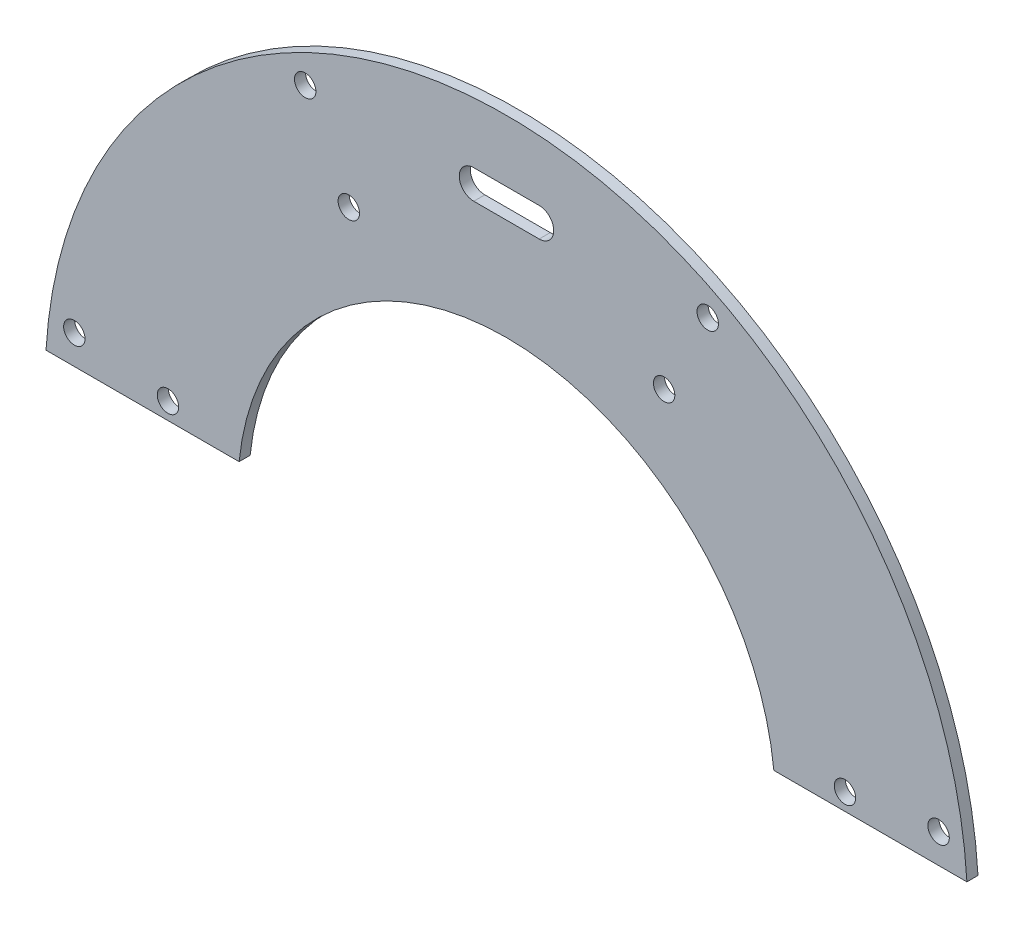
ISO-10303-21;
HEADER;
FILE_DESCRIPTION(('STEP AP214'),'2;1');
FILE_NAME('part.step','',(''),(''),'','','');
FILE_SCHEMA(('AUTOMOTIVE_DESIGN { 1 0 10303 214 1 1 1 1 }'));
ENDSEC;
DATA;
#1=APPLICATION_CONTEXT('core data for automotive mechanical design processes');
#2=APPLICATION_PROTOCOL_DEFINITION('international standard','automotive_design',2000,#1);
#3=PRODUCT_CONTEXT('',#1,'mechanical');
#4=PRODUCT('Part','Part','',(#3));
#5=PRODUCT_RELATED_PRODUCT_CATEGORY('part','',(#4));
#6=PRODUCT_DEFINITION_FORMATION('','',#4);
#7=PRODUCT_DEFINITION_CONTEXT('part definition',#1,'design');
#8=PRODUCT_DEFINITION('design','',#6,#7);
#9=PRODUCT_DEFINITION_SHAPE('','',#8);
#10=(LENGTH_UNIT() NAMED_UNIT(*) SI_UNIT(.MILLI.,.METRE.));
#11=(NAMED_UNIT(*) PLANE_ANGLE_UNIT() SI_UNIT($,.RADIAN.));
#12=(NAMED_UNIT(*) SI_UNIT($,.STERADIAN.) SOLID_ANGLE_UNIT());
#13=UNCERTAINTY_MEASURE_WITH_UNIT(LENGTH_MEASURE(1.E-05),#10,'distance_accuracy_value','');
#14=(GEOMETRIC_REPRESENTATION_CONTEXT(3) GLOBAL_UNCERTAINTY_ASSIGNED_CONTEXT((#13)) GLOBAL_UNIT_ASSIGNED_CONTEXT((#10,
#11,#12)) REPRESENTATION_CONTEXT('',''));
#15=CARTESIAN_POINT('',(0.,0.,0.));
#16=DIRECTION('',(0.,0.,1.));
#17=DIRECTION('',(1.,0.,0.));
#18=AXIS2_PLACEMENT_3D('',#15,#16,#17);
#19=CARTESIAN_POINT('',(0.,0.,0.762));
#20=DIRECTION('',(0.,0.,-1.));
#21=DIRECTION('',(-1.,0.,0.));
#22=AXIS2_PLACEMENT_3D('',#19,#20,#21);
#23=CYLINDRICAL_SURFACE('',#22,63.5);
#24=CARTESIAN_POINT('',(0.,0.,-0.762));
#25=DIRECTION('',(0.,0.,1.));
#26=DIRECTION('',(1.,0.,0.));
#27=AXIS2_PLACEMENT_3D('',#24,#25,#26);
#28=CIRCLE('',#27,63.5);
#29=CARTESIAN_POINT('',(63.3861972356758,3.79999999999999,-0.762));
#30=VERTEX_POINT('',#29);
#31=CARTESIAN_POINT('',(-63.3861972356758,3.79999999999999,-0.762));
#32=VERTEX_POINT('',#31);
#33=EDGE_CURVE('E175',#30,#32,#28,.T.);
#34=ORIENTED_EDGE('',*,*,#33,.T.);
#35=DIRECTION('',(0.,0.,-1.));
#36=VECTOR('',#35,1.);
#37=CARTESIAN_POINT('',(-63.3861972356758,3.79999999999999,0.762));
#38=LINE('',#37,#36);
#39=CARTESIAN_POINT('',(-63.3861972356758,3.79999999999999,0.762));
#40=VERTEX_POINT('',#39);
#41=EDGE_CURVE('E11',#40,#32,#38,.T.);
#42=ORIENTED_EDGE('',*,*,#41,.F.);
#43=CARTESIAN_POINT('',(0.,0.,0.762));
#44=DIRECTION('',(0.,0.,1.));
#45=DIRECTION('',(1.,0.,0.));
#46=AXIS2_PLACEMENT_3D('',#43,#44,#45);
#47=CIRCLE('',#46,63.5);
#48=CARTESIAN_POINT('',(63.3861972356758,3.79999999999999,0.762));
#49=VERTEX_POINT('',#48);
#50=EDGE_CURVE('E176',#49,#40,#47,.T.);
#51=ORIENTED_EDGE('',*,*,#50,.F.);
#52=DIRECTION('',(0.,0.,-1.));
#53=VECTOR('',#52,1.);
#54=CARTESIAN_POINT('',(63.3861972356758,3.79999999999999,0.762));
#55=LINE('',#54,#53);
#56=EDGE_CURVE('E186',#49,#30,#55,.T.);
#57=ORIENTED_EDGE('',*,*,#56,.T.);
#58=EDGE_LOOP('',(#34,#42,#51,#57));
#59=FACE_BOUND('',#58,.T.);
#60=ADVANCED_FACE('F34',(#59),#23,.T.);
#61=CARTESIAN_POINT('',(-63.3861972356758,3.79999999999999,0.762));
#62=DIRECTION('',(0.,1.,0.));
#63=DIRECTION('',(0.,0.,1.));
#64=AXIS2_PLACEMENT_3D('',#61,#62,#63);
#65=PLANE('',#64);
#66=DIRECTION('',(1.,0.,0.));
#67=VECTOR('',#66,1.);
#68=CARTESIAN_POINT('',(-63.3861972356758,3.79999999999999,-0.762));
#69=LINE('',#68,#67);
#70=CARTESIAN_POINT('',(-36.804347569275,3.79999999999999,-0.762));
#71=VERTEX_POINT('',#70);
#72=EDGE_CURVE('E189',#32,#71,#69,.T.);
#73=ORIENTED_EDGE('',*,*,#72,.T.);
#74=DIRECTION('',(0.,0.,-1.));
#75=VECTOR('',#74,1.);
#76=CARTESIAN_POINT('',(-36.804347569275,3.79999999999999,0.762));
#77=LINE('',#76,#75);
#78=CARTESIAN_POINT('',(-36.804347569275,3.79999999999999,0.762));
#79=VERTEX_POINT('',#78);
#80=EDGE_CURVE('E42',#79,#71,#77,.T.);
#81=ORIENTED_EDGE('',*,*,#80,.F.);
#82=DIRECTION('',(1.,0.,0.));
#83=VECTOR('',#82,1.);
#84=CARTESIAN_POINT('',(-63.3861972356758,3.79999999999999,0.762));
#85=LINE('',#84,#83);
#86=EDGE_CURVE('E179',#40,#79,#85,.T.);
#87=ORIENTED_EDGE('',*,*,#86,.F.);
#88=ORIENTED_EDGE('',*,*,#41,.T.);
#89=EDGE_LOOP('',(#73,#81,#87,#88));
#90=FACE_BOUND('',#89,.T.);
#91=ADVANCED_FACE('F225',(#90),#65,.F.);
#92=CARTESIAN_POINT('',(0.,0.,0.762));
#93=DIRECTION('',(0.,0.,-1.));
#94=DIRECTION('',(-1.,0.,0.));
#95=AXIS2_PLACEMENT_3D('',#92,#93,#94);
#96=CYLINDRICAL_SURFACE('',#95,37.);
#97=CARTESIAN_POINT('',(0.,0.,-0.762));
#98=DIRECTION('',(0.,0.,-1.));
#99=DIRECTION('',(-1.,0.,0.));
#100=AXIS2_PLACEMENT_3D('',#97,#98,#99);
#101=CIRCLE('',#100,37.);
#102=CARTESIAN_POINT('',(36.804347569275,3.79999999999998,-0.762));
#103=VERTEX_POINT('',#102);
#104=EDGE_CURVE('E191',#71,#103,#101,.T.);
#105=ORIENTED_EDGE('',*,*,#104,.T.);
#106=DIRECTION('',(0.,0.,-1.));
#107=VECTOR('',#106,1.);
#108=CARTESIAN_POINT('',(36.804347569275,3.79999999999998,0.762));
#109=LINE('',#108,#107);
#110=CARTESIAN_POINT('',(36.804347569275,3.79999999999998,0.762));
#111=VERTEX_POINT('',#110);
#112=EDGE_CURVE('E196',#111,#103,#109,.T.);
#113=ORIENTED_EDGE('',*,*,#112,.F.);
#114=CARTESIAN_POINT('',(0.,0.,0.762));
#115=DIRECTION('',(0.,0.,-1.));
#116=DIRECTION('',(-1.,0.,0.));
#117=AXIS2_PLACEMENT_3D('',#114,#115,#116);
#118=CIRCLE('',#117,37.);
#119=EDGE_CURVE('E182',#79,#111,#118,.T.);
#120=ORIENTED_EDGE('',*,*,#119,.F.);
#121=ORIENTED_EDGE('',*,*,#80,.T.);
#122=EDGE_LOOP('',(#105,#113,#120,#121));
#123=FACE_BOUND('',#122,.T.);
#124=ADVANCED_FACE('F230',(#123),#96,.F.);
#125=CARTESIAN_POINT('',(36.804347569275,3.79999999999999,0.762));
#126=DIRECTION('',(0.,1.,0.));
#127=DIRECTION('',(0.,0.,1.));
#128=AXIS2_PLACEMENT_3D('',#125,#126,#127);
#129=PLANE('',#128);
#130=DIRECTION('',(1.,0.,0.));
#131=VECTOR('',#130,1.);
#132=CARTESIAN_POINT('',(36.804347569275,3.79999999999999,-0.762));
#133=LINE('',#132,#131);
#134=EDGE_CURVE('E180',#103,#30,#133,.T.);
#135=ORIENTED_EDGE('',*,*,#134,.T.);
#136=ORIENTED_EDGE('',*,*,#56,.F.);
#137=DIRECTION('',(1.,0.,0.));
#138=VECTOR('',#137,1.);
#139=CARTESIAN_POINT('',(36.804347569275,3.79999999999999,0.762));
#140=LINE('',#139,#138);
#141=EDGE_CURVE('E184',#111,#49,#140,.T.);
#142=ORIENTED_EDGE('',*,*,#141,.F.);
#143=ORIENTED_EDGE('',*,*,#112,.T.);
#144=EDGE_LOOP('',(#135,#136,#142,#143));
#145=FACE_BOUND('',#144,.T.);
#146=ADVANCED_FACE('F246',(#145),#129,.F.);
#147=CARTESIAN_POINT('',(0.,0.,0.762));
#148=DIRECTION('',(0.,0.,1.));
#149=DIRECTION('',(1.,0.,0.));
#150=AXIS2_PLACEMENT_3D('',#147,#148,#149);
#151=PLANE('',#150);
#152=CARTESIAN_POINT('',(-4.50000000000001,53.,0.762));
#153=DIRECTION('',(0.,0.,1.));
#154=DIRECTION('',(1.,0.,0.));
#155=AXIS2_PLACEMENT_3D('',#152,#153,#154);
#156=CIRCLE('',#155,2.);
#157=CARTESIAN_POINT('',(-4.50000000000001,55.,0.762));
#158=VERTEX_POINT('',#157);
#159=CARTESIAN_POINT('',(-4.50000000000001,51.,0.762));
#160=VERTEX_POINT('',#159);
#161=EDGE_CURVE('E50',#158,#160,#156,.T.);
#162=ORIENTED_EDGE('',*,*,#161,.F.);
#163=DIRECTION('',(-1.,0.,0.));
#164=VECTOR('',#163,1.);
#165=CARTESIAN_POINT('',(-4.50000000000001,55.,0.762));
#166=LINE('',#165,#164);
#167=CARTESIAN_POINT('',(4.49999999999999,55.,0.762));
#168=VERTEX_POINT('',#167);
#169=EDGE_CURVE('E118',#168,#158,#166,.T.);
#170=ORIENTED_EDGE('',*,*,#169,.F.);
#171=CARTESIAN_POINT('',(4.49999999999999,53.,0.762));
#172=DIRECTION('',(0.,0.,1.));
#173=DIRECTION('',(1.,0.,0.));
#174=AXIS2_PLACEMENT_3D('',#171,#172,#173);
#175=CIRCLE('',#174,2.);
#176=CARTESIAN_POINT('',(4.49999999999999,51.,0.762));
#177=VERTEX_POINT('',#176);
#178=EDGE_CURVE('E121',#177,#168,#175,.T.);
#179=ORIENTED_EDGE('',*,*,#178,.F.);
#180=DIRECTION('',(1.,0.,0.));
#181=VECTOR('',#180,1.);
#182=CARTESIAN_POINT('',(-4.50000000000001,51.,0.762));
#183=LINE('',#182,#181);
#184=EDGE_CURVE('E127',#160,#177,#183,.T.);
#185=ORIENTED_EDGE('',*,*,#184,.F.);
#186=EDGE_LOOP('',(#162,#170,#179,#185));
#187=FACE_BOUND('',#186,.T.);
#188=CARTESIAN_POINT('',(59.4866916824287,7.8315715332027,0.762000000000001));
#189=DIRECTION('',(0.,0.,1.));
#190=DIRECTION('',(1.,0.,0.));
#191=AXIS2_PLACEMENT_3D('',#188,#189,#190);
#192=CIRCLE('',#191,1.47319999999999);
#193=CARTESIAN_POINT('',(60.9598916824287,7.8315715332027,0.762000000000001));
#194=VERTEX_POINT('',#193);
#195=EDGE_CURVE('E133',#194,#194,#192,.T.);
#196=ORIENTED_EDGE('',*,*,#195,.F.);
#197=EDGE_LOOP('',(#196));
#198=FACE_BOUND('',#197,.T.);
#199=CARTESIAN_POINT('',(46.5979084845691,6.13473103434212,0.762000000000001));
#200=DIRECTION('',(0.,0.,1.));
#201=DIRECTION('',(1.,0.,0.));
#202=AXIS2_PLACEMENT_3D('',#199,#200,#201);
#203=CIRCLE('',#202,1.47319999999999);
#204=CARTESIAN_POINT('',(48.0711084845691,6.13473103434212,0.762000000000001));
#205=VERTEX_POINT('',#204);
#206=EDGE_CURVE('E139',#205,#205,#203,.T.);
#207=ORIENTED_EDGE('',*,*,#206,.F.);
#208=EDGE_LOOP('',(#207));
#209=FACE_BOUND('',#208,.T.);
#210=CARTESIAN_POINT('',(27.7049167941023,53.2206499906932,0.762000000000001));
#211=DIRECTION('',(0.,0.,1.));
#212=DIRECTION('',(1.,0.,0.));
#213=AXIS2_PLACEMENT_3D('',#210,#211,#212);
#214=CIRCLE('',#213,1.47319999999999);
#215=CARTESIAN_POINT('',(29.1781167941023,53.2206499906932,0.762000000000001));
#216=VERTEX_POINT('',#215);
#217=EDGE_CURVE('E143',#216,#216,#214,.T.);
#218=ORIENTED_EDGE('',*,*,#217,.F.);
#219=EDGE_LOOP('',(#218));
#220=FACE_BOUND('',#219,.T.);
#221=CARTESIAN_POINT('',(21.7021848220468,41.6895091593763,0.762000000000001));
#222=DIRECTION('',(0.,0.,1.));
#223=DIRECTION('',(1.,0.,0.));
#224=AXIS2_PLACEMENT_3D('',#221,#222,#223);
#225=CIRCLE('',#224,1.47319999999999);
#226=CARTESIAN_POINT('',(23.1753848220468,41.6895091593763,0.762000000000001));
#227=VERTEX_POINT('',#226);
#228=EDGE_CURVE('E149',#227,#227,#225,.T.);
#229=ORIENTED_EDGE('',*,*,#228,.F.);
#230=EDGE_LOOP('',(#229));
#231=FACE_BOUND('',#230,.T.);
#232=CARTESIAN_POINT('',(-27.7049167941019,53.2206499906934,0.762000000000001));
#233=DIRECTION('',(0.,0.,1.));
#234=DIRECTION('',(1.,0.,0.));
#235=AXIS2_PLACEMENT_3D('',#232,#233,#234);
#236=CIRCLE('',#235,1.47319999999999);
#237=CARTESIAN_POINT('',(-26.2317167941019,53.2206499906934,0.762000000000001));
#238=VERTEX_POINT('',#237);
#239=EDGE_CURVE('E153',#238,#238,#236,.T.);
#240=ORIENTED_EDGE('',*,*,#239,.F.);
#241=EDGE_LOOP('',(#240));
#242=FACE_BOUND('',#241,.T.);
#243=CARTESIAN_POINT('',(-21.7021848220465,41.6895091593765,0.762000000000001));
#244=DIRECTION('',(0.,0.,1.));
#245=DIRECTION('',(1.,0.,0.));
#246=AXIS2_PLACEMENT_3D('',#243,#244,#245);
#247=CIRCLE('',#246,1.47319999999999);
#248=CARTESIAN_POINT('',(-20.2289848220465,41.6895091593765,0.762000000000001));
#249=VERTEX_POINT('',#248);
#250=EDGE_CURVE('E159',#249,#249,#247,.T.);
#251=ORIENTED_EDGE('',*,*,#250,.F.);
#252=EDGE_LOOP('',(#251));
#253=FACE_BOUND('',#252,.T.);
#254=CARTESIAN_POINT('',(-59.4866916824286,7.83157153320311,0.762000000000001));
#255=DIRECTION('',(0.,0.,1.));
#256=DIRECTION('',(1.,0.,0.));
#257=AXIS2_PLACEMENT_3D('',#254,#255,#256);
#258=CIRCLE('',#257,1.47319999999999);
#259=CARTESIAN_POINT('',(-58.0134916824286,7.83157153320311,0.762000000000001));
#260=VERTEX_POINT('',#259);
#261=EDGE_CURVE('E165',#260,#260,#258,.T.);
#262=ORIENTED_EDGE('',*,*,#261,.F.);
#263=EDGE_LOOP('',(#262));
#264=FACE_BOUND('',#263,.T.);
#265=CARTESIAN_POINT('',(-46.5979084845691,6.13473103434243,0.762000000000001));
#266=DIRECTION('',(0.,0.,1.));
#267=DIRECTION('',(1.,0.,0.));
#268=AXIS2_PLACEMENT_3D('',#265,#266,#267);
#269=CIRCLE('',#268,1.47319999999999);
#270=CARTESIAN_POINT('',(-45.1247084845691,6.13473103434243,0.762000000000001));
#271=VERTEX_POINT('',#270);
#272=EDGE_CURVE('E169',#271,#271,#269,.T.);
#273=ORIENTED_EDGE('',*,*,#272,.F.);
#274=EDGE_LOOP('',(#273));
#275=FACE_BOUND('',#274,.T.);
#276=ORIENTED_EDGE('',*,*,#50,.T.);
#277=ORIENTED_EDGE('',*,*,#86,.T.);
#278=ORIENTED_EDGE('',*,*,#119,.T.);
#279=ORIENTED_EDGE('',*,*,#141,.T.);
#280=EDGE_LOOP('',(#276,#277,#278,#279));
#281=FACE_BOUND('',#280,.T.);
#282=ADVANCED_FACE('F242',(#187,#198,#209,#220,#231,#242,#253,#264,#275,#281),#151,.T.);
#283=CARTESIAN_POINT('',(0.,0.,-0.762));
#284=DIRECTION('',(0.,0.,1.));
#285=DIRECTION('',(1.,0.,0.));
#286=AXIS2_PLACEMENT_3D('',#283,#284,#285);
#287=PLANE('',#286);
#288=DIRECTION('',(-1.,0.,0.));
#289=VECTOR('',#288,1.);
#290=CARTESIAN_POINT('',(-4.50000000000001,55.,-0.762));
#291=LINE('',#290,#289);
#292=CARTESIAN_POINT('',(4.49999999999999,55.,-0.762));
#293=VERTEX_POINT('',#292);
#294=CARTESIAN_POINT('',(-4.50000000000001,55.,-0.762));
#295=VERTEX_POINT('',#294);
#296=EDGE_CURVE('E108',#293,#295,#291,.T.);
#297=ORIENTED_EDGE('',*,*,#296,.T.);
#298=CARTESIAN_POINT('',(-4.50000000000001,53.,-0.762));
#299=DIRECTION('',(0.,0.,1.));
#300=DIRECTION('',(1.,0.,0.));
#301=AXIS2_PLACEMENT_3D('',#298,#299,#300);
#302=CIRCLE('',#301,2.);
#303=CARTESIAN_POINT('',(-4.50000000000001,51.,-0.762));
#304=VERTEX_POINT('',#303);
#305=EDGE_CURVE('E102',#295,#304,#302,.T.);
#306=ORIENTED_EDGE('',*,*,#305,.T.);
#307=DIRECTION('',(1.,0.,0.));
#308=VECTOR('',#307,1.);
#309=CARTESIAN_POINT('',(-4.50000000000001,51.,-0.762));
#310=LINE('',#309,#308);
#311=CARTESIAN_POINT('',(4.49999999999999,51.,-0.762));
#312=VERTEX_POINT('',#311);
#313=EDGE_CURVE('E111',#304,#312,#310,.T.);
#314=ORIENTED_EDGE('',*,*,#313,.T.);
#315=CARTESIAN_POINT('',(4.49999999999999,53.,-0.762));
#316=DIRECTION('',(0.,0.,1.));
#317=DIRECTION('',(1.,0.,0.));
#318=AXIS2_PLACEMENT_3D('',#315,#316,#317);
#319=CIRCLE('',#318,2.);
#320=EDGE_CURVE('E58',#312,#293,#319,.T.);
#321=ORIENTED_EDGE('',*,*,#320,.T.);
#322=EDGE_LOOP('',(#297,#306,#314,#321));
#323=FACE_BOUND('',#322,.T.);
#324=CARTESIAN_POINT('',(59.4866916824287,7.8315715332027,-0.762));
#325=DIRECTION('',(0.,0.,1.));
#326=DIRECTION('',(1.,0.,0.));
#327=AXIS2_PLACEMENT_3D('',#324,#325,#326);
#328=CIRCLE('',#327,1.47319999999998);
#329=CARTESIAN_POINT('',(60.9598916824287,7.8315715332027,-0.762));
#330=VERTEX_POINT('',#329);
#331=EDGE_CURVE('E37',#330,#330,#328,.T.);
#332=ORIENTED_EDGE('',*,*,#331,.T.);
#333=EDGE_LOOP('',(#332));
#334=FACE_BOUND('',#333,.T.);
#335=CARTESIAN_POINT('',(46.5979084845691,6.13473103434212,-0.762));
#336=DIRECTION('',(0.,0.,1.));
#337=DIRECTION('',(1.,0.,0.));
#338=AXIS2_PLACEMENT_3D('',#335,#336,#337);
#339=CIRCLE('',#338,1.47319999999998);
#340=CARTESIAN_POINT('',(48.0711084845691,6.13473103434212,-0.762));
#341=VERTEX_POINT('',#340);
#342=EDGE_CURVE('E142',#341,#341,#339,.T.);
#343=ORIENTED_EDGE('',*,*,#342,.T.);
#344=EDGE_LOOP('',(#343));
#345=FACE_BOUND('',#344,.T.);
#346=CARTESIAN_POINT('',(27.7049167941023,53.2206499906932,-0.762));
#347=DIRECTION('',(0.,0.,1.));
#348=DIRECTION('',(1.,0.,0.));
#349=AXIS2_PLACEMENT_3D('',#346,#347,#348);
#350=CIRCLE('',#349,1.47319999999998);
#351=CARTESIAN_POINT('',(29.1781167941022,53.2206499906932,-0.762));
#352=VERTEX_POINT('',#351);
#353=EDGE_CURVE('E146',#352,#352,#350,.T.);
#354=ORIENTED_EDGE('',*,*,#353,.T.);
#355=EDGE_LOOP('',(#354));
#356=FACE_BOUND('',#355,.T.);
#357=CARTESIAN_POINT('',(21.7021848220468,41.6895091593763,-0.762));
#358=DIRECTION('',(0.,0.,1.));
#359=DIRECTION('',(1.,0.,0.));
#360=AXIS2_PLACEMENT_3D('',#357,#358,#359);
#361=CIRCLE('',#360,1.47319999999998);
#362=CARTESIAN_POINT('',(23.1753848220468,41.6895091593763,-0.762));
#363=VERTEX_POINT('',#362);
#364=EDGE_CURVE('E152',#363,#363,#361,.T.);
#365=ORIENTED_EDGE('',*,*,#364,.T.);
#366=EDGE_LOOP('',(#365));
#367=FACE_BOUND('',#366,.T.);
#368=CARTESIAN_POINT('',(-27.7049167941019,53.2206499906934,-0.762));
#369=DIRECTION('',(0.,0.,1.));
#370=DIRECTION('',(1.,0.,0.));
#371=AXIS2_PLACEMENT_3D('',#368,#369,#370);
#372=CIRCLE('',#371,1.47319999999998);
#373=CARTESIAN_POINT('',(-26.2317167941019,53.2206499906934,-0.762));
#374=VERTEX_POINT('',#373);
#375=EDGE_CURVE('E156',#374,#374,#372,.T.);
#376=ORIENTED_EDGE('',*,*,#375,.T.);
#377=EDGE_LOOP('',(#376));
#378=FACE_BOUND('',#377,.T.);
#379=CARTESIAN_POINT('',(-21.7021848220465,41.6895091593765,-0.762));
#380=DIRECTION('',(0.,0.,1.));
#381=DIRECTION('',(1.,0.,0.));
#382=AXIS2_PLACEMENT_3D('',#379,#380,#381);
#383=CIRCLE('',#382,1.47319999999998);
#384=CARTESIAN_POINT('',(-20.2289848220465,41.6895091593765,-0.762));
#385=VERTEX_POINT('',#384);
#386=EDGE_CURVE('E162',#385,#385,#383,.T.);
#387=ORIENTED_EDGE('',*,*,#386,.T.);
#388=EDGE_LOOP('',(#387));
#389=FACE_BOUND('',#388,.T.);
#390=CARTESIAN_POINT('',(-59.4866916824286,7.83157153320311,-0.762));
#391=DIRECTION('',(0.,0.,1.));
#392=DIRECTION('',(1.,0.,0.));
#393=AXIS2_PLACEMENT_3D('',#390,#391,#392);
#394=CIRCLE('',#393,1.47319999999998);
#395=CARTESIAN_POINT('',(-58.0134916824287,7.83157153320311,-0.762));
#396=VERTEX_POINT('',#395);
#397=EDGE_CURVE('E168',#396,#396,#394,.T.);
#398=ORIENTED_EDGE('',*,*,#397,.T.);
#399=EDGE_LOOP('',(#398));
#400=FACE_BOUND('',#399,.T.);
#401=CARTESIAN_POINT('',(-46.5979084845691,6.13473103434243,-0.762));
#402=DIRECTION('',(0.,0.,1.));
#403=DIRECTION('',(1.,0.,0.));
#404=AXIS2_PLACEMENT_3D('',#401,#402,#403);
#405=CIRCLE('',#404,1.47319999999998);
#406=CARTESIAN_POINT('',(-45.1247084845691,6.13473103434243,-0.762));
#407=VERTEX_POINT('',#406);
#408=EDGE_CURVE('E172',#407,#407,#405,.T.);
#409=ORIENTED_EDGE('',*,*,#408,.T.);
#410=EDGE_LOOP('',(#409));
#411=FACE_BOUND('',#410,.T.);
#412=ORIENTED_EDGE('',*,*,#33,.F.);
#413=ORIENTED_EDGE('',*,*,#134,.F.);
#414=ORIENTED_EDGE('',*,*,#104,.F.);
#415=ORIENTED_EDGE('',*,*,#72,.F.);
#416=EDGE_LOOP('',(#412,#413,#414,#415));
#417=FACE_BOUND('',#416,.T.);
#418=ADVANCED_FACE('F115',(#323,#334,#345,#356,#367,#378,#389,#400,#411,#417),#287,.F.);
#419=CARTESIAN_POINT('',(-46.5979084845691,6.13473103434243,0.762));
#420=DIRECTION('',(0.,0.,1.));
#421=DIRECTION('',(1.,0.,0.));
#422=AXIS2_PLACEMENT_3D('',#419,#420,#421);
#423=CYLINDRICAL_SURFACE('',#422,1.47319999999998);
#424=ORIENTED_EDGE('',*,*,#272,.T.);
#425=EDGE_LOOP('',(#424));
#426=FACE_BOUND('',#425,.T.);
#427=ORIENTED_EDGE('',*,*,#408,.F.);
#428=EDGE_LOOP('',(#427));
#429=FACE_BOUND('',#428,.T.);
#430=ADVANCED_FACE('F257',(#426,#429),#423,.F.);
#431=CARTESIAN_POINT('',(-59.4866916824286,7.83157153320311,0.762));
#432=DIRECTION('',(0.,0.,1.));
#433=DIRECTION('',(1.,0.,0.));
#434=AXIS2_PLACEMENT_3D('',#431,#432,#433);
#435=CYLINDRICAL_SURFACE('',#434,1.47319999999998);
#436=ORIENTED_EDGE('',*,*,#261,.T.);
#437=EDGE_LOOP('',(#436));
#438=FACE_BOUND('',#437,.T.);
#439=ORIENTED_EDGE('',*,*,#397,.F.);
#440=EDGE_LOOP('',(#439));
#441=FACE_BOUND('',#440,.T.);
#442=ADVANCED_FACE('F263',(#438,#441),#435,.F.);
#443=CARTESIAN_POINT('',(-21.7021848220465,41.6895091593765,0.762));
#444=DIRECTION('',(0.,0.,1.));
#445=DIRECTION('',(1.,0.,0.));
#446=AXIS2_PLACEMENT_3D('',#443,#444,#445);
#447=CYLINDRICAL_SURFACE('',#446,1.47319999999998);
#448=ORIENTED_EDGE('',*,*,#250,.T.);
#449=EDGE_LOOP('',(#448));
#450=FACE_BOUND('',#449,.T.);
#451=ORIENTED_EDGE('',*,*,#386,.F.);
#452=EDGE_LOOP('',(#451));
#453=FACE_BOUND('',#452,.T.);
#454=ADVANCED_FACE('F267',(#450,#453),#447,.F.);
#455=CARTESIAN_POINT('',(-27.7049167941019,53.2206499906934,0.762));
#456=DIRECTION('',(0.,0.,1.));
#457=DIRECTION('',(1.,0.,0.));
#458=AXIS2_PLACEMENT_3D('',#455,#456,#457);
#459=CYLINDRICAL_SURFACE('',#458,1.47319999999998);
#460=ORIENTED_EDGE('',*,*,#239,.T.);
#461=EDGE_LOOP('',(#460));
#462=FACE_BOUND('',#461,.T.);
#463=ORIENTED_EDGE('',*,*,#375,.F.);
#464=EDGE_LOOP('',(#463));
#465=FACE_BOUND('',#464,.T.);
#466=ADVANCED_FACE('F271',(#462,#465),#459,.F.);
#467=CARTESIAN_POINT('',(21.7021848220468,41.6895091593763,0.762));
#468=DIRECTION('',(0.,0.,1.));
#469=DIRECTION('',(1.,0.,0.));
#470=AXIS2_PLACEMENT_3D('',#467,#468,#469);
#471=CYLINDRICAL_SURFACE('',#470,1.47319999999998);
#472=ORIENTED_EDGE('',*,*,#228,.T.);
#473=EDGE_LOOP('',(#472));
#474=FACE_BOUND('',#473,.T.);
#475=ORIENTED_EDGE('',*,*,#364,.F.);
#476=EDGE_LOOP('',(#475));
#477=FACE_BOUND('',#476,.T.);
#478=ADVANCED_FACE('F221',(#474,#477),#471,.F.);
#479=CARTESIAN_POINT('',(27.7049167941023,53.2206499906932,0.762));
#480=DIRECTION('',(0.,0.,1.));
#481=DIRECTION('',(1.,0.,0.));
#482=AXIS2_PLACEMENT_3D('',#479,#480,#481);
#483=CYLINDRICAL_SURFACE('',#482,1.47319999999998);
#484=ORIENTED_EDGE('',*,*,#217,.T.);
#485=EDGE_LOOP('',(#484));
#486=FACE_BOUND('',#485,.T.);
#487=ORIENTED_EDGE('',*,*,#353,.F.);
#488=EDGE_LOOP('',(#487));
#489=FACE_BOUND('',#488,.T.);
#490=ADVANCED_FACE('F212',(#486,#489),#483,.F.);
#491=CARTESIAN_POINT('',(46.5979084845691,6.13473103434212,0.762));
#492=DIRECTION('',(0.,0.,1.));
#493=DIRECTION('',(1.,0.,0.));
#494=AXIS2_PLACEMENT_3D('',#491,#492,#493);
#495=CYLINDRICAL_SURFACE('',#494,1.47319999999998);
#496=ORIENTED_EDGE('',*,*,#206,.T.);
#497=EDGE_LOOP('',(#496));
#498=FACE_BOUND('',#497,.T.);
#499=ORIENTED_EDGE('',*,*,#342,.F.);
#500=EDGE_LOOP('',(#499));
#501=FACE_BOUND('',#500,.T.);
#502=ADVANCED_FACE('F209',(#498,#501),#495,.F.);
#503=CARTESIAN_POINT('',(59.4866916824287,7.8315715332027,0.762));
#504=DIRECTION('',(0.,0.,1.));
#505=DIRECTION('',(1.,0.,0.));
#506=AXIS2_PLACEMENT_3D('',#503,#504,#505);
#507=CYLINDRICAL_SURFACE('',#506,1.47319999999998);
#508=ORIENTED_EDGE('',*,*,#195,.T.);
#509=EDGE_LOOP('',(#508));
#510=FACE_BOUND('',#509,.T.);
#511=ORIENTED_EDGE('',*,*,#331,.F.);
#512=EDGE_LOOP('',(#511));
#513=FACE_BOUND('',#512,.T.);
#514=ADVANCED_FACE('F211',(#510,#513),#507,.F.);
#515=CARTESIAN_POINT('',(-4.50000000000001,53.,-0.762));
#516=DIRECTION('',(0.,0.,1.));
#517=DIRECTION('',(1.,0.,0.));
#518=AXIS2_PLACEMENT_3D('',#515,#516,#517);
#519=CYLINDRICAL_SURFACE('',#518,2.);
#520=ORIENTED_EDGE('',*,*,#161,.T.);
#521=DIRECTION('',(0.,0.,1.));
#522=VECTOR('',#521,1.);
#523=CARTESIAN_POINT('',(-4.50000000000001,51.,-0.762));
#524=LINE('',#523,#522);
#525=EDGE_CURVE('E98',#304,#160,#524,.T.);
#526=ORIENTED_EDGE('',*,*,#525,.F.);
#527=ORIENTED_EDGE('',*,*,#305,.F.);
#528=DIRECTION('',(0.,0.,1.));
#529=VECTOR('',#528,1.);
#530=CARTESIAN_POINT('',(-4.50000000000001,55.,-0.762));
#531=LINE('',#530,#529);
#532=EDGE_CURVE('E131',#295,#158,#531,.T.);
#533=ORIENTED_EDGE('',*,*,#532,.T.);
#534=EDGE_LOOP('',(#520,#526,#527,#533));
#535=FACE_BOUND('',#534,.T.);
#536=ADVANCED_FACE('F100',(#535),#519,.F.);
#537=CARTESIAN_POINT('',(-4.50000000000001,55.,-0.762));
#538=DIRECTION('',(0.,1.,0.));
#539=DIRECTION('',(0.,0.,1.));
#540=AXIS2_PLACEMENT_3D('',#537,#538,#539);
#541=PLANE('',#540);
#542=ORIENTED_EDGE('',*,*,#169,.T.);
#543=ORIENTED_EDGE('',*,*,#532,.F.);
#544=ORIENTED_EDGE('',*,*,#296,.F.);
#545=DIRECTION('',(0.,0.,1.));
#546=VECTOR('',#545,1.);
#547=CARTESIAN_POINT('',(4.49999999999999,55.,-0.762));
#548=LINE('',#547,#546);
#549=EDGE_CURVE('E134',#293,#168,#548,.T.);
#550=ORIENTED_EDGE('',*,*,#549,.T.);
#551=EDGE_LOOP('',(#542,#543,#544,#550));
#552=FACE_BOUND('',#551,.T.);
#553=ADVANCED_FACE('F344',(#552),#541,.F.);
#554=CARTESIAN_POINT('',(4.49999999999999,53.,-0.762));
#555=DIRECTION('',(0.,0.,1.));
#556=DIRECTION('',(1.,0.,0.));
#557=AXIS2_PLACEMENT_3D('',#554,#555,#556);
#558=CYLINDRICAL_SURFACE('',#557,2.);
#559=ORIENTED_EDGE('',*,*,#178,.T.);
#560=ORIENTED_EDGE('',*,*,#549,.F.);
#561=ORIENTED_EDGE('',*,*,#320,.F.);
#562=DIRECTION('',(0.,0.,1.));
#563=VECTOR('',#562,1.);
#564=CARTESIAN_POINT('',(4.49999999999999,51.,-0.762));
#565=LINE('',#564,#563);
#566=EDGE_CURVE('E107',#312,#177,#565,.T.);
#567=ORIENTED_EDGE('',*,*,#566,.T.);
#568=EDGE_LOOP('',(#559,#560,#561,#567));
#569=FACE_BOUND('',#568,.T.);
#570=ADVANCED_FACE('F353',(#569),#558,.F.);
#571=CARTESIAN_POINT('',(-4.50000000000001,51.,-0.762));
#572=DIRECTION('',(0.,-1.,0.));
#573=DIRECTION('',(0.,0.,-1.));
#574=AXIS2_PLACEMENT_3D('',#571,#572,#573);
#575=PLANE('',#574);
#576=ORIENTED_EDGE('',*,*,#184,.T.);
#577=ORIENTED_EDGE('',*,*,#566,.F.);
#578=ORIENTED_EDGE('',*,*,#313,.F.);
#579=ORIENTED_EDGE('',*,*,#525,.T.);
#580=EDGE_LOOP('',(#576,#577,#578,#579));
#581=FACE_BOUND('',#580,.T.);
#582=ADVANCED_FACE('F112',(#581),#575,.F.);
#583=CLOSED_SHELL('',(#60,#91,#124,#146,#282,#418,#430,#442,#454,#466,#478,#490,#502,#514,#536,
#553,#570,#582));
#584=MANIFOLD_SOLID_BREP('B2',#583);
#585=ADVANCED_BREP_SHAPE_REPRESENTATION('',(#18,#584),#14);
#586=SHAPE_DEFINITION_REPRESENTATION(#9,#585);
ENDSEC;
END-ISO-10303-21;
